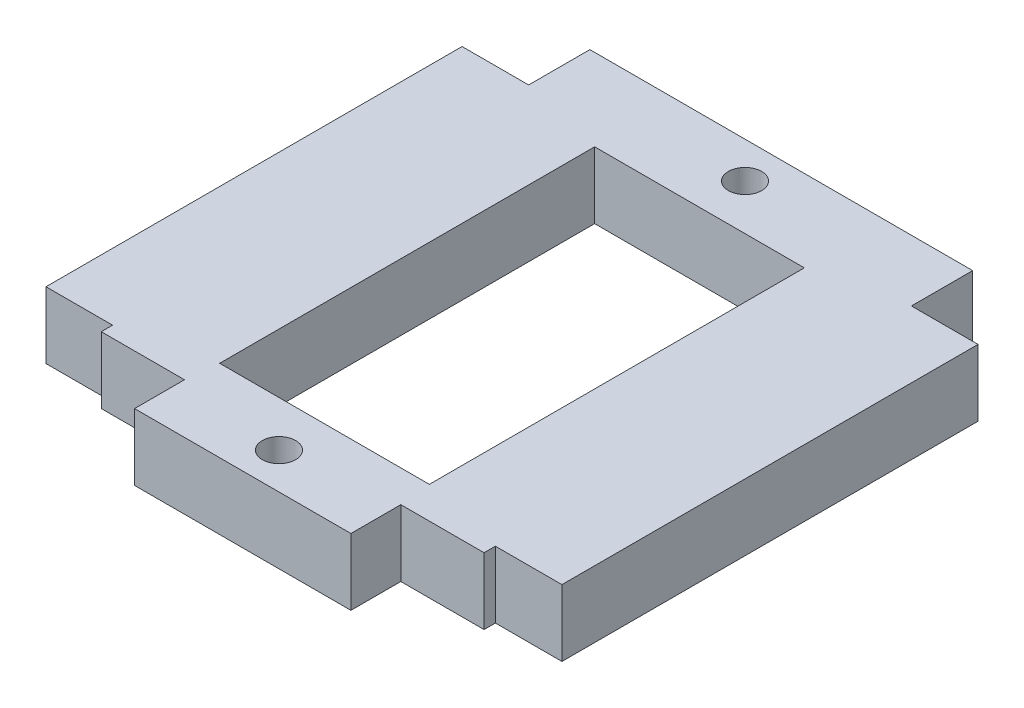
ISO-10303-21;
HEADER;
FILE_DESCRIPTION(('STEP AP214'),'2;1');
FILE_NAME('part.step','',(''),(''),'','','');
FILE_SCHEMA(('AUTOMOTIVE_DESIGN { 1 0 10303 214 1 1 1 1 }'));
ENDSEC;
DATA;
#1=APPLICATION_CONTEXT('core data for automotive mechanical design processes');
#2=APPLICATION_PROTOCOL_DEFINITION('international standard','automotive_design',2000,#1);
#3=PRODUCT_CONTEXT('',#1,'mechanical');
#4=PRODUCT('Part','Part','',(#3));
#5=PRODUCT_RELATED_PRODUCT_CATEGORY('part','',(#4));
#6=PRODUCT_DEFINITION_FORMATION('','',#4);
#7=PRODUCT_DEFINITION_CONTEXT('part definition',#1,'design');
#8=PRODUCT_DEFINITION('design','',#6,#7);
#9=PRODUCT_DEFINITION_SHAPE('','',#8);
#10=(LENGTH_UNIT() NAMED_UNIT(*) SI_UNIT(.MILLI.,.METRE.));
#11=(NAMED_UNIT(*) PLANE_ANGLE_UNIT() SI_UNIT($,.RADIAN.));
#12=(NAMED_UNIT(*) SI_UNIT($,.STERADIAN.) SOLID_ANGLE_UNIT());
#13=UNCERTAINTY_MEASURE_WITH_UNIT(LENGTH_MEASURE(1.E-05),#10,'distance_accuracy_value','');
#14=(GEOMETRIC_REPRESENTATION_CONTEXT(3) GLOBAL_UNCERTAINTY_ASSIGNED_CONTEXT((#13)) GLOBAL_UNIT_ASSIGNED_CONTEXT((#10,
#11,#12)) REPRESENTATION_CONTEXT('',''));
#15=CARTESIAN_POINT('',(0.,0.,0.));
#16=DIRECTION('',(0.,0.,1.));
#17=DIRECTION('',(1.,0.,0.));
#18=AXIS2_PLACEMENT_3D('',#15,#16,#17);
#19=CARTESIAN_POINT('',(0.,4.,6.2992));
#20=DIRECTION('',(0.,0.,1.));
#21=DIRECTION('',(1.,0.,0.));
#22=AXIS2_PLACEMENT_3D('',#19,#20,#21);
#23=PLANE('',#22);
#24=DIRECTION('',(-1.,0.,0.));
#25=VECTOR('',#24,1.);
#26=CARTESIAN_POINT('',(0.,0.,6.2992));
#27=LINE('',#26,#25);
#28=CARTESIAN_POINT('',(6.2992,0.,6.2992));
#29=VERTEX_POINT('',#28);
#30=CARTESIAN_POINT('',(-6.2992,0.,6.2992));
#31=VERTEX_POINT('',#30);
#32=EDGE_CURVE('E257',#29,#31,#27,.T.);
#33=ORIENTED_EDGE('',*,*,#32,.T.);
#34=DIRECTION('',(0.,-1.,0.));
#35=VECTOR('',#34,1.);
#36=CARTESIAN_POINT('',(-6.2992,4.,6.2992));
#37=LINE('',#36,#35);
#38=CARTESIAN_POINT('',(-6.2992,4.,6.2992));
#39=VERTEX_POINT('',#38);
#40=EDGE_CURVE('E11',#39,#31,#37,.T.);
#41=ORIENTED_EDGE('',*,*,#40,.F.);
#42=DIRECTION('',(-1.,0.,0.));
#43=VECTOR('',#42,1.);
#44=CARTESIAN_POINT('',(0.,4.,6.2992));
#45=LINE('',#44,#43);
#46=CARTESIAN_POINT('',(6.2992,4.,6.2992));
#47=VERTEX_POINT('',#46);
#48=EDGE_CURVE('E186',#47,#39,#45,.T.);
#49=ORIENTED_EDGE('',*,*,#48,.F.);
#50=DIRECTION('',(0.,-1.,0.));
#51=VECTOR('',#50,1.);
#52=CARTESIAN_POINT('',(6.2992,4.,6.2992));
#53=LINE('',#52,#51);
#54=EDGE_CURVE('E54',#47,#29,#53,.T.);
#55=ORIENTED_EDGE('',*,*,#54,.T.);
#56=EDGE_LOOP('',(#33,#41,#49,#55));
#57=FACE_BOUND('',#56,.T.);
#58=ADVANCED_FACE('F35',(#57),#23,.F.);
#59=CARTESIAN_POINT('',(-6.2992,4.,0.));
#60=DIRECTION('',(-1.,0.,0.));
#61=DIRECTION('',(0.,0.,1.));
#62=AXIS2_PLACEMENT_3D('',#59,#60,#61);
#63=PLANE('',#62);
#64=DIRECTION('',(0.,0.,-1.));
#65=VECTOR('',#64,1.);
#66=CARTESIAN_POINT('',(-6.2992,0.,0.));
#67=LINE('',#66,#65);
#68=CARTESIAN_POINT('',(-6.2992,0.,-16.2306));
#69=VERTEX_POINT('',#68);
#70=EDGE_CURVE('E192',#31,#69,#67,.T.);
#71=ORIENTED_EDGE('',*,*,#70,.T.);
#72=DIRECTION('',(0.,-1.,0.));
#73=VECTOR('',#72,1.);
#74=CARTESIAN_POINT('',(-6.2992,4.,-16.2306));
#75=LINE('',#74,#73);
#76=CARTESIAN_POINT('',(-6.2992,4.,-16.2306));
#77=VERTEX_POINT('',#76);
#78=EDGE_CURVE('E45',#77,#69,#75,.T.);
#79=ORIENTED_EDGE('',*,*,#78,.F.);
#80=DIRECTION('',(0.,0.,-1.));
#81=VECTOR('',#80,1.);
#82=CARTESIAN_POINT('',(-6.2992,4.,0.));
#83=LINE('',#82,#81);
#84=EDGE_CURVE('E180',#39,#77,#83,.T.);
#85=ORIENTED_EDGE('',*,*,#84,.F.);
#86=ORIENTED_EDGE('',*,*,#40,.T.);
#87=EDGE_LOOP('',(#71,#79,#85,#86));
#88=FACE_BOUND('',#87,.T.);
#89=ADVANCED_FACE('F191',(#88),#63,.F.);
#90=CARTESIAN_POINT('',(0.,4.,-16.2306));
#91=DIRECTION('',(0.,0.,1.));
#92=DIRECTION('',(1.,0.,0.));
#93=AXIS2_PLACEMENT_3D('',#90,#91,#92);
#94=PLANE('',#93);
#95=DIRECTION('',(-1.,0.,0.));
#96=VECTOR('',#95,1.);
#97=CARTESIAN_POINT('',(0.,0.,-16.2306));
#98=LINE('',#97,#96);
#99=CARTESIAN_POINT('',(6.2992,0.,-16.2306));
#100=VERTEX_POINT('',#99);
#101=EDGE_CURVE('E260',#100,#69,#98,.T.);
#102=ORIENTED_EDGE('',*,*,#101,.F.);
#103=DIRECTION('',(0.,-1.,0.));
#104=VECTOR('',#103,1.);
#105=CARTESIAN_POINT('',(6.2992,4.,-16.2306));
#106=LINE('',#105,#104);
#107=CARTESIAN_POINT('',(6.2992,4.,-16.2306));
#108=VERTEX_POINT('',#107);
#109=EDGE_CURVE('E116',#108,#100,#106,.T.);
#110=ORIENTED_EDGE('',*,*,#109,.F.);
#111=DIRECTION('',(-1.,0.,0.));
#112=VECTOR('',#111,1.);
#113=CARTESIAN_POINT('',(0.,4.,-16.2306));
#114=LINE('',#113,#112);
#115=EDGE_CURVE('E185',#108,#77,#114,.T.);
#116=ORIENTED_EDGE('',*,*,#115,.T.);
#117=ORIENTED_EDGE('',*,*,#78,.T.);
#118=EDGE_LOOP('',(#102,#110,#116,#117));
#119=FACE_BOUND('',#118,.T.);
#120=ADVANCED_FACE('F196',(#119),#94,.T.);
#121=CARTESIAN_POINT('',(-6.49999999999999,4.,0.));
#122=DIRECTION('',(-1.,0.,0.));
#123=DIRECTION('',(0.,0.,1.));
#124=AXIS2_PLACEMENT_3D('',#121,#122,#123);
#125=PLANE('',#124);
#126=DIRECTION('',(0.,0.,-1.));
#127=VECTOR('',#126,1.);
#128=CARTESIAN_POINT('',(-6.49999999999999,0.,0.));
#129=LINE('',#128,#127);
#130=CARTESIAN_POINT('',(-6.49999999999999,0.,11.2141000000001));
#131=VERTEX_POINT('',#130);
#132=CARTESIAN_POINT('',(-6.49999999999999,0.,8.21410000000005));
#133=VERTEX_POINT('',#132);
#134=EDGE_CURVE('E203',#131,#133,#129,.T.);
#135=ORIENTED_EDGE('',*,*,#134,.F.);
#136=DIRECTION('',(0.,-1.,0.));
#137=VECTOR('',#136,1.);
#138=CARTESIAN_POINT('',(-6.49999999999999,4.,11.2141000000001));
#139=LINE('',#138,#137);
#140=CARTESIAN_POINT('',(-6.49999999999999,4.,11.2141000000001));
#141=VERTEX_POINT('',#140);
#142=EDGE_CURVE('E39',#141,#131,#139,.T.);
#143=ORIENTED_EDGE('',*,*,#142,.F.);
#144=DIRECTION('',(0.,0.,-1.));
#145=VECTOR('',#144,1.);
#146=CARTESIAN_POINT('',(-6.49999999999999,4.,0.));
#147=LINE('',#146,#145);
#148=CARTESIAN_POINT('',(-6.49999999999999,4.,8.21410000000005));
#149=VERTEX_POINT('',#148);
#150=EDGE_CURVE('E265',#141,#149,#147,.T.);
#151=ORIENTED_EDGE('',*,*,#150,.T.);
#152=DIRECTION('',(0.,-1.,0.));
#153=VECTOR('',#152,1.);
#154=CARTESIAN_POINT('',(-6.49999999999999,4.,8.21410000000005));
#155=LINE('',#154,#153);
#156=EDGE_CURVE('E199',#149,#133,#155,.T.);
#157=ORIENTED_EDGE('',*,*,#156,.T.);
#158=EDGE_LOOP('',(#135,#143,#151,#157));
#159=FACE_BOUND('',#158,.T.);
#160=ADVANCED_FACE('F37',(#159),#125,.T.);
#161=CARTESIAN_POINT('',(0.,4.,11.2141000000001));
#162=DIRECTION('',(0.,0.,1.));
#163=DIRECTION('',(1.,0.,0.));
#164=AXIS2_PLACEMENT_3D('',#161,#162,#163);
#165=PLANE('',#164);
#166=DIRECTION('',(-1.,0.,0.));
#167=VECTOR('',#166,1.);
#168=CARTESIAN_POINT('',(0.,0.,11.2141000000001));
#169=LINE('',#168,#167);
#170=CARTESIAN_POINT('',(6.50000000000001,0.,11.2141000000001));
#171=VERTEX_POINT('',#170);
#172=EDGE_CURVE('E206',#171,#131,#169,.T.);
#173=ORIENTED_EDGE('',*,*,#172,.F.);
#174=DIRECTION('',(0.,-1.,0.));
#175=VECTOR('',#174,1.);
#176=CARTESIAN_POINT('',(6.50000000000001,4.,11.2141000000001));
#177=LINE('',#176,#175);
#178=CARTESIAN_POINT('',(6.50000000000001,4.,11.2141000000001));
#179=VERTEX_POINT('',#178);
#180=EDGE_CURVE('E294',#179,#171,#177,.T.);
#181=ORIENTED_EDGE('',*,*,#180,.F.);
#182=DIRECTION('',(-1.,0.,0.));
#183=VECTOR('',#182,1.);
#184=CARTESIAN_POINT('',(0.,4.,11.2141000000001));
#185=LINE('',#184,#183);
#186=EDGE_CURVE('E303',#179,#141,#185,.T.);
#187=ORIENTED_EDGE('',*,*,#186,.T.);
#188=ORIENTED_EDGE('',*,*,#142,.T.);
#189=EDGE_LOOP('',(#173,#181,#187,#188));
#190=FACE_BOUND('',#189,.T.);
#191=ADVANCED_FACE('F301',(#190),#165,.T.);
#192=CARTESIAN_POINT('',(6.50000000000001,4.,0.));
#193=DIRECTION('',(-1.,0.,0.));
#194=DIRECTION('',(0.,0.,1.));
#195=AXIS2_PLACEMENT_3D('',#192,#193,#194);
#196=PLANE('',#195);
#197=DIRECTION('',(0.,0.,-1.));
#198=VECTOR('',#197,1.);
#199=CARTESIAN_POINT('',(6.50000000000001,0.,0.));
#200=LINE('',#199,#198);
#201=CARTESIAN_POINT('',(6.50000000000001,0.,8.21410000000005));
#202=VERTEX_POINT('',#201);
#203=EDGE_CURVE('E209',#171,#202,#200,.T.);
#204=ORIENTED_EDGE('',*,*,#203,.T.);
#205=DIRECTION('',(0.,-1.,0.));
#206=VECTOR('',#205,1.);
#207=CARTESIAN_POINT('',(6.50000000000001,4.,8.21410000000005));
#208=LINE('',#207,#206);
#209=CARTESIAN_POINT('',(6.50000000000001,4.,8.21410000000005));
#210=VERTEX_POINT('',#209);
#211=EDGE_CURVE('E293',#210,#202,#208,.T.);
#212=ORIENTED_EDGE('',*,*,#211,.F.);
#213=DIRECTION('',(0.,0.,-1.));
#214=VECTOR('',#213,1.);
#215=CARTESIAN_POINT('',(6.50000000000001,4.,0.));
#216=LINE('',#215,#214);
#217=EDGE_CURVE('E313',#179,#210,#216,.T.);
#218=ORIENTED_EDGE('',*,*,#217,.F.);
#219=ORIENTED_EDGE('',*,*,#180,.T.);
#220=EDGE_LOOP('',(#204,#212,#218,#219));
#221=FACE_BOUND('',#220,.T.);
#222=ADVANCED_FACE('F311',(#221),#196,.F.);
#223=CARTESIAN_POINT('',(0.,4.,8.21410000000005));
#224=DIRECTION('',(0.,0.,1.));
#225=DIRECTION('',(1.,0.,0.));
#226=AXIS2_PLACEMENT_3D('',#223,#224,#225);
#227=PLANE('',#226);
#228=DIRECTION('',(-1.,0.,0.));
#229=VECTOR('',#228,1.);
#230=CARTESIAN_POINT('',(0.,0.,8.21410000000005));
#231=LINE('',#230,#229);
#232=CARTESIAN_POINT('',(11.5,0.,8.21410000000005));
#233=VERTEX_POINT('',#232);
#234=EDGE_CURVE('E212',#233,#202,#231,.T.);
#235=ORIENTED_EDGE('',*,*,#234,.F.);
#236=DIRECTION('',(0.,-1.,0.));
#237=VECTOR('',#236,1.);
#238=CARTESIAN_POINT('',(11.5,4.,8.21410000000005));
#239=LINE('',#238,#237);
#240=CARTESIAN_POINT('',(11.5,4.,8.21410000000005));
#241=VERTEX_POINT('',#240);
#242=EDGE_CURVE('E291',#241,#233,#239,.T.);
#243=ORIENTED_EDGE('',*,*,#242,.F.);
#244=DIRECTION('',(-1.,0.,0.));
#245=VECTOR('',#244,1.);
#246=CARTESIAN_POINT('',(0.,4.,8.21410000000005));
#247=LINE('',#246,#245);
#248=EDGE_CURVE('E316',#241,#210,#247,.T.);
#249=ORIENTED_EDGE('',*,*,#248,.T.);
#250=ORIENTED_EDGE('',*,*,#211,.T.);
#251=EDGE_LOOP('',(#235,#243,#249,#250));
#252=FACE_BOUND('',#251,.T.);
#253=ADVANCED_FACE('F317',(#252),#227,.T.);
#254=CARTESIAN_POINT('',(11.5,4.,0.));
#255=DIRECTION('',(1.,0.,0.));
#256=DIRECTION('',(0.,0.,-1.));
#257=AXIS2_PLACEMENT_3D('',#254,#255,#256);
#258=PLANE('',#257);
#259=DIRECTION('',(0.,0.,1.));
#260=VECTOR('',#259,1.);
#261=CARTESIAN_POINT('',(11.5,0.,0.));
#262=LINE('',#261,#260);
#263=CARTESIAN_POINT('',(11.5,0.,7.53430000000001));
#264=VERTEX_POINT('',#263);
#265=EDGE_CURVE('E215',#264,#233,#262,.T.);
#266=ORIENTED_EDGE('',*,*,#265,.F.);
#267=DIRECTION('',(0.,-1.,0.));
#268=VECTOR('',#267,1.);
#269=CARTESIAN_POINT('',(11.5,4.,7.53430000000001));
#270=LINE('',#269,#268);
#271=CARTESIAN_POINT('',(11.5,4.,7.53430000000001));
#272=VERTEX_POINT('',#271);
#273=EDGE_CURVE('E289',#272,#264,#270,.T.);
#274=ORIENTED_EDGE('',*,*,#273,.F.);
#275=DIRECTION('',(0.,0.,1.));
#276=VECTOR('',#275,1.);
#277=CARTESIAN_POINT('',(11.5,4.,0.));
#278=LINE('',#277,#276);
#279=EDGE_CURVE('E321',#272,#241,#278,.T.);
#280=ORIENTED_EDGE('',*,*,#279,.T.);
#281=ORIENTED_EDGE('',*,*,#242,.T.);
#282=EDGE_LOOP('',(#266,#274,#280,#281));
#283=FACE_BOUND('',#282,.T.);
#284=ADVANCED_FACE('F435',(#283),#258,.T.);
#285=CARTESIAN_POINT('',(0.,4.,7.5343));
#286=DIRECTION('',(0.,0.,1.));
#287=DIRECTION('',(1.,0.,0.));
#288=AXIS2_PLACEMENT_3D('',#285,#286,#287);
#289=PLANE('',#288);
#290=DIRECTION('',(-1.,0.,0.));
#291=VECTOR('',#290,1.);
#292=CARTESIAN_POINT('',(0.,0.,7.5343));
#293=LINE('',#292,#291);
#294=CARTESIAN_POINT('',(15.5,0.,7.53430000000001));
#295=VERTEX_POINT('',#294);
#296=EDGE_CURVE('E218',#295,#264,#293,.T.);
#297=ORIENTED_EDGE('',*,*,#296,.F.);
#298=DIRECTION('',(0.,-1.,0.));
#299=VECTOR('',#298,1.);
#300=CARTESIAN_POINT('',(15.5,4.,7.53430000000001));
#301=LINE('',#300,#299);
#302=CARTESIAN_POINT('',(15.5,4.,7.53430000000001));
#303=VERTEX_POINT('',#302);
#304=EDGE_CURVE('E287',#303,#295,#301,.T.);
#305=ORIENTED_EDGE('',*,*,#304,.F.);
#306=DIRECTION('',(-1.,0.,0.));
#307=VECTOR('',#306,1.);
#308=CARTESIAN_POINT('',(0.,4.,7.5343));
#309=LINE('',#308,#307);
#310=EDGE_CURVE('E323',#303,#272,#309,.T.);
#311=ORIENTED_EDGE('',*,*,#310,.T.);
#312=ORIENTED_EDGE('',*,*,#273,.T.);
#313=EDGE_LOOP('',(#297,#305,#311,#312));
#314=FACE_BOUND('',#313,.T.);
#315=ADVANCED_FACE('F431',(#314),#289,.T.);
#316=CARTESIAN_POINT('',(15.5,4.,0.));
#317=DIRECTION('',(-1.,0.,0.));
#318=DIRECTION('',(0.,0.,1.));
#319=AXIS2_PLACEMENT_3D('',#316,#317,#318);
#320=PLANE('',#319);
#321=DIRECTION('',(0.,0.,-1.));
#322=VECTOR('',#321,1.);
#323=CARTESIAN_POINT('',(15.5,0.,0.));
#324=LINE('',#323,#322);
#325=CARTESIAN_POINT('',(15.5,0.,-17.4657));
#326=VERTEX_POINT('',#325);
#327=EDGE_CURVE('E221',#295,#326,#324,.T.);
#328=ORIENTED_EDGE('',*,*,#327,.T.);
#329=DIRECTION('',(0.,-1.,0.));
#330=VECTOR('',#329,1.);
#331=CARTESIAN_POINT('',(15.5,4.,-17.4657));
#332=LINE('',#331,#330);
#333=CARTESIAN_POINT('',(15.5,4.,-17.4657));
#334=VERTEX_POINT('',#333);
#335=EDGE_CURVE('E285',#334,#326,#332,.T.);
#336=ORIENTED_EDGE('',*,*,#335,.F.);
#337=DIRECTION('',(0.,0.,-1.));
#338=VECTOR('',#337,1.);
#339=CARTESIAN_POINT('',(15.5,4.,0.));
#340=LINE('',#339,#338);
#341=EDGE_CURVE('E330',#303,#334,#340,.T.);
#342=ORIENTED_EDGE('',*,*,#341,.F.);
#343=ORIENTED_EDGE('',*,*,#304,.T.);
#344=EDGE_LOOP('',(#328,#336,#342,#343));
#345=FACE_BOUND('',#344,.T.);
#346=ADVANCED_FACE('F427',(#345),#320,.F.);
#347=CARTESIAN_POINT('',(0.,4.,-17.4657));
#348=DIRECTION('',(0.,0.,-1.));
#349=DIRECTION('',(-1.,0.,0.));
#350=AXIS2_PLACEMENT_3D('',#347,#348,#349);
#351=PLANE('',#350);
#352=DIRECTION('',(1.,0.,0.));
#353=VECTOR('',#352,1.);
#354=CARTESIAN_POINT('',(0.,0.,-17.4657));
#355=LINE('',#354,#353);
#356=CARTESIAN_POINT('',(11.5,0.,-17.4657));
#357=VERTEX_POINT('',#356);
#358=EDGE_CURVE('E224',#357,#326,#355,.T.);
#359=ORIENTED_EDGE('',*,*,#358,.F.);
#360=DIRECTION('',(0.,-1.,0.));
#361=VECTOR('',#360,1.);
#362=CARTESIAN_POINT('',(11.5,4.,-17.4657));
#363=LINE('',#362,#361);
#364=CARTESIAN_POINT('',(11.5,4.,-17.4657));
#365=VERTEX_POINT('',#364);
#366=EDGE_CURVE('E283',#365,#357,#363,.T.);
#367=ORIENTED_EDGE('',*,*,#366,.F.);
#368=DIRECTION('',(1.,0.,0.));
#369=VECTOR('',#368,1.);
#370=CARTESIAN_POINT('',(0.,4.,-17.4657));
#371=LINE('',#370,#369);
#372=EDGE_CURVE('E332',#365,#334,#371,.T.);
#373=ORIENTED_EDGE('',*,*,#372,.T.);
#374=ORIENTED_EDGE('',*,*,#335,.T.);
#375=EDGE_LOOP('',(#359,#367,#373,#374));
#376=FACE_BOUND('',#375,.T.);
#377=ADVANCED_FACE('F423',(#376),#351,.T.);
#378=CARTESIAN_POINT('',(11.5,4.,0.));
#379=DIRECTION('',(1.,0.,0.));
#380=DIRECTION('',(0.,0.,-1.));
#381=AXIS2_PLACEMENT_3D('',#378,#379,#380);
#382=PLANE('',#381);
#383=DIRECTION('',(0.,0.,1.));
#384=VECTOR('',#383,1.);
#385=CARTESIAN_POINT('',(11.5,0.,0.));
#386=LINE('',#385,#384);
#387=CARTESIAN_POINT('',(11.5,0.,-21.1455000000001));
#388=VERTEX_POINT('',#387);
#389=EDGE_CURVE('E227',#388,#357,#386,.T.);
#390=ORIENTED_EDGE('',*,*,#389,.F.);
#391=DIRECTION('',(0.,-1.,0.));
#392=VECTOR('',#391,1.);
#393=CARTESIAN_POINT('',(11.5,4.,-21.1455000000001));
#394=LINE('',#393,#392);
#395=CARTESIAN_POINT('',(11.5,4.,-21.1455000000001));
#396=VERTEX_POINT('',#395);
#397=EDGE_CURVE('E281',#396,#388,#394,.T.);
#398=ORIENTED_EDGE('',*,*,#397,.F.);
#399=DIRECTION('',(0.,0.,1.));
#400=VECTOR('',#399,1.);
#401=CARTESIAN_POINT('',(11.5,4.,0.));
#402=LINE('',#401,#400);
#403=EDGE_CURVE('E335',#396,#365,#402,.T.);
#404=ORIENTED_EDGE('',*,*,#403,.T.);
#405=ORIENTED_EDGE('',*,*,#366,.T.);
#406=EDGE_LOOP('',(#390,#398,#404,#405));
#407=FACE_BOUND('',#406,.T.);
#408=ADVANCED_FACE('F419',(#407),#382,.T.);
#409=CARTESIAN_POINT('',(0.,4.,-21.1455000000001));
#410=DIRECTION('',(0.,0.,-1.));
#411=DIRECTION('',(-1.,0.,0.));
#412=AXIS2_PLACEMENT_3D('',#409,#410,#411);
#413=PLANE('',#412);
#414=DIRECTION('',(1.,0.,0.));
#415=VECTOR('',#414,1.);
#416=CARTESIAN_POINT('',(0.,0.,-21.1455000000001));
#417=LINE('',#416,#415);
#418=CARTESIAN_POINT('',(-11.5,0.,-21.1455000000001));
#419=VERTEX_POINT('',#418);
#420=EDGE_CURVE('E230',#419,#388,#417,.T.);
#421=ORIENTED_EDGE('',*,*,#420,.F.);
#422=DIRECTION('',(0.,-1.,0.));
#423=VECTOR('',#422,1.);
#424=CARTESIAN_POINT('',(-11.5,4.,-21.1455000000001));
#425=LINE('',#424,#423);
#426=CARTESIAN_POINT('',(-11.5,4.,-21.1455000000001));
#427=VERTEX_POINT('',#426);
#428=EDGE_CURVE('E279',#427,#419,#425,.T.);
#429=ORIENTED_EDGE('',*,*,#428,.F.);
#430=DIRECTION('',(1.,0.,0.));
#431=VECTOR('',#430,1.);
#432=CARTESIAN_POINT('',(0.,4.,-21.1455000000001));
#433=LINE('',#432,#431);
#434=EDGE_CURVE('E338',#427,#396,#433,.T.);
#435=ORIENTED_EDGE('',*,*,#434,.T.);
#436=ORIENTED_EDGE('',*,*,#397,.T.);
#437=EDGE_LOOP('',(#421,#429,#435,#436));
#438=FACE_BOUND('',#437,.T.);
#439=ADVANCED_FACE('F415',(#438),#413,.T.);
#440=CARTESIAN_POINT('',(-11.5,4.,0.));
#441=DIRECTION('',(-1.,0.,0.));
#442=DIRECTION('',(0.,0.,1.));
#443=AXIS2_PLACEMENT_3D('',#440,#441,#442);
#444=PLANE('',#443);
#445=DIRECTION('',(0.,0.,-1.));
#446=VECTOR('',#445,1.);
#447=CARTESIAN_POINT('',(-11.5,0.,0.));
#448=LINE('',#447,#446);
#449=CARTESIAN_POINT('',(-11.5,0.,-17.4657));
#450=VERTEX_POINT('',#449);
#451=EDGE_CURVE('E233',#450,#419,#448,.T.);
#452=ORIENTED_EDGE('',*,*,#451,.F.);
#453=DIRECTION('',(0.,-1.,0.));
#454=VECTOR('',#453,1.);
#455=CARTESIAN_POINT('',(-11.5,4.,-17.4657));
#456=LINE('',#455,#454);
#457=CARTESIAN_POINT('',(-11.5,4.,-17.4657));
#458=VERTEX_POINT('',#457);
#459=EDGE_CURVE('E277',#458,#450,#456,.T.);
#460=ORIENTED_EDGE('',*,*,#459,.F.);
#461=DIRECTION('',(0.,0.,-1.));
#462=VECTOR('',#461,1.);
#463=CARTESIAN_POINT('',(-11.5,4.,0.));
#464=LINE('',#463,#462);
#465=EDGE_CURVE('E341',#458,#427,#464,.T.);
#466=ORIENTED_EDGE('',*,*,#465,.T.);
#467=ORIENTED_EDGE('',*,*,#428,.T.);
#468=EDGE_LOOP('',(#452,#460,#466,#467));
#469=FACE_BOUND('',#468,.T.);
#470=ADVANCED_FACE('F411',(#469),#444,.T.);
#471=CARTESIAN_POINT('',(0.,4.,-17.4657));
#472=DIRECTION('',(0.,0.,-1.));
#473=DIRECTION('',(-1.,0.,0.));
#474=AXIS2_PLACEMENT_3D('',#471,#472,#473);
#475=PLANE('',#474);
#476=DIRECTION('',(1.,0.,0.));
#477=VECTOR('',#476,1.);
#478=CARTESIAN_POINT('',(0.,0.,-17.4657));
#479=LINE('',#478,#477);
#480=CARTESIAN_POINT('',(-15.5,0.,-17.4657));
#481=VERTEX_POINT('',#480);
#482=EDGE_CURVE('E236',#481,#450,#479,.T.);
#483=ORIENTED_EDGE('',*,*,#482,.F.);
#484=DIRECTION('',(0.,-1.,0.));
#485=VECTOR('',#484,1.);
#486=CARTESIAN_POINT('',(-15.5,4.,-17.4657));
#487=LINE('',#486,#485);
#488=CARTESIAN_POINT('',(-15.5,4.,-17.4657));
#489=VERTEX_POINT('',#488);
#490=EDGE_CURVE('E275',#489,#481,#487,.T.);
#491=ORIENTED_EDGE('',*,*,#490,.F.);
#492=DIRECTION('',(1.,0.,0.));
#493=VECTOR('',#492,1.);
#494=CARTESIAN_POINT('',(0.,4.,-17.4657));
#495=LINE('',#494,#493);
#496=EDGE_CURVE('E344',#489,#458,#495,.T.);
#497=ORIENTED_EDGE('',*,*,#496,.T.);
#498=ORIENTED_EDGE('',*,*,#459,.T.);
#499=EDGE_LOOP('',(#483,#491,#497,#498));
#500=FACE_BOUND('',#499,.T.);
#501=ADVANCED_FACE('F407',(#500),#475,.T.);
#502=CARTESIAN_POINT('',(-15.5,4.,0.));
#503=DIRECTION('',(-1.,0.,0.));
#504=DIRECTION('',(0.,0.,1.));
#505=AXIS2_PLACEMENT_3D('',#502,#503,#504);
#506=PLANE('',#505);
#507=DIRECTION('',(0.,0.,-1.));
#508=VECTOR('',#507,1.);
#509=CARTESIAN_POINT('',(-15.5,0.,0.));
#510=LINE('',#509,#508);
#511=CARTESIAN_POINT('',(-15.5,0.,7.53429999999999));
#512=VERTEX_POINT('',#511);
#513=EDGE_CURVE('E239',#512,#481,#510,.T.);
#514=ORIENTED_EDGE('',*,*,#513,.F.);
#515=DIRECTION('',(0.,-1.,0.));
#516=VECTOR('',#515,1.);
#517=CARTESIAN_POINT('',(-15.5,4.,7.53429999999999));
#518=LINE('',#517,#516);
#519=CARTESIAN_POINT('',(-15.5,4.,7.53429999999999));
#520=VERTEX_POINT('',#519);
#521=EDGE_CURVE('E273',#520,#512,#518,.T.);
#522=ORIENTED_EDGE('',*,*,#521,.F.);
#523=DIRECTION('',(0.,0.,-1.));
#524=VECTOR('',#523,1.);
#525=CARTESIAN_POINT('',(-15.5,4.,0.));
#526=LINE('',#525,#524);
#527=EDGE_CURVE('E347',#520,#489,#526,.T.);
#528=ORIENTED_EDGE('',*,*,#527,.T.);
#529=ORIENTED_EDGE('',*,*,#490,.T.);
#530=EDGE_LOOP('',(#514,#522,#528,#529));
#531=FACE_BOUND('',#530,.T.);
#532=ADVANCED_FACE('F403',(#531),#506,.T.);
#533=CARTESIAN_POINT('',(0.,4.,7.53429999999999));
#534=DIRECTION('',(0.,0.,1.));
#535=DIRECTION('',(1.,0.,0.));
#536=AXIS2_PLACEMENT_3D('',#533,#534,#535);
#537=PLANE('',#536);
#538=DIRECTION('',(-1.,0.,0.));
#539=VECTOR('',#538,1.);
#540=CARTESIAN_POINT('',(0.,0.,7.53429999999999));
#541=LINE('',#540,#539);
#542=CARTESIAN_POINT('',(-11.5,0.,7.53429999999999));
#543=VERTEX_POINT('',#542);
#544=EDGE_CURVE('E242',#543,#512,#541,.T.);
#545=ORIENTED_EDGE('',*,*,#544,.F.);
#546=DIRECTION('',(0.,-1.,0.));
#547=VECTOR('',#546,1.);
#548=CARTESIAN_POINT('',(-11.5,4.,7.53429999999999));
#549=LINE('',#548,#547);
#550=CARTESIAN_POINT('',(-11.5,4.,7.53429999999999));
#551=VERTEX_POINT('',#550);
#552=EDGE_CURVE('E271',#551,#543,#549,.T.);
#553=ORIENTED_EDGE('',*,*,#552,.F.);
#554=DIRECTION('',(-1.,0.,0.));
#555=VECTOR('',#554,1.);
#556=CARTESIAN_POINT('',(0.,4.,7.53429999999999));
#557=LINE('',#556,#555);
#558=EDGE_CURVE('E350',#551,#520,#557,.T.);
#559=ORIENTED_EDGE('',*,*,#558,.T.);
#560=ORIENTED_EDGE('',*,*,#521,.T.);
#561=EDGE_LOOP('',(#545,#553,#559,#560));
#562=FACE_BOUND('',#561,.T.);
#563=ADVANCED_FACE('F399',(#562),#537,.T.);
#564=CARTESIAN_POINT('',(-11.5,4.,0.));
#565=DIRECTION('',(-1.,0.,0.));
#566=DIRECTION('',(0.,0.,1.));
#567=AXIS2_PLACEMENT_3D('',#564,#565,#566);
#568=PLANE('',#567);
#569=DIRECTION('',(0.,0.,-1.));
#570=VECTOR('',#569,1.);
#571=CARTESIAN_POINT('',(-11.5,0.,0.));
#572=LINE('',#571,#570);
#573=CARTESIAN_POINT('',(-11.5,0.,8.21410000000005));
#574=VERTEX_POINT('',#573);
#575=EDGE_CURVE('E245',#574,#543,#572,.T.);
#576=ORIENTED_EDGE('',*,*,#575,.F.);
#577=DIRECTION('',(0.,-1.,0.));
#578=VECTOR('',#577,1.);
#579=CARTESIAN_POINT('',(-11.5,4.,8.21410000000005));
#580=LINE('',#579,#578);
#581=CARTESIAN_POINT('',(-11.5,4.,8.21410000000005));
#582=VERTEX_POINT('',#581);
#583=EDGE_CURVE('E269',#582,#574,#580,.T.);
#584=ORIENTED_EDGE('',*,*,#583,.F.);
#585=DIRECTION('',(0.,0.,-1.));
#586=VECTOR('',#585,1.);
#587=CARTESIAN_POINT('',(-11.5,4.,0.));
#588=LINE('',#587,#586);
#589=EDGE_CURVE('E353',#582,#551,#588,.T.);
#590=ORIENTED_EDGE('',*,*,#589,.T.);
#591=ORIENTED_EDGE('',*,*,#552,.T.);
#592=EDGE_LOOP('',(#576,#584,#590,#591));
#593=FACE_BOUND('',#592,.T.);
#594=ADVANCED_FACE('F390',(#593),#568,.T.);
#595=CARTESIAN_POINT('',(0.,4.,-18.9674000000001));
#596=DIRECTION('',(0.,-1.,0.));
#597=DIRECTION('',(0.,0.,-1.));
#598=AXIS2_PLACEMENT_3D('',#595,#596,#597);
#599=CYLINDRICAL_SURFACE('',#598,1.);
#600=CARTESIAN_POINT('',(0.,4.,-18.9674000000001));
#601=DIRECTION('',(0.,1.,0.));
#602=DIRECTION('',(0.,0.,1.));
#603=AXIS2_PLACEMENT_3D('',#600,#601,#602);
#604=CIRCLE('',#603,1.);
#605=CARTESIAN_POINT('',(0.,4.,-17.9674000000001));
#606=VERTEX_POINT('',#605);
#607=EDGE_CURVE('E361',#606,#606,#604,.T.);
#608=ORIENTED_EDGE('',*,*,#607,.T.);
#609=EDGE_LOOP('',(#608));
#610=FACE_BOUND('',#609,.T.);
#611=CARTESIAN_POINT('',(0.,0.,-18.9674000000001));
#612=DIRECTION('',(0.,1.,0.));
#613=DIRECTION('',(0.,0.,1.));
#614=AXIS2_PLACEMENT_3D('',#611,#612,#613);
#615=CIRCLE('',#614,1.);
#616=CARTESIAN_POINT('',(0.,0.,-17.9674000000001));
#617=VERTEX_POINT('',#616);
#618=EDGE_CURVE('E254',#617,#617,#615,.T.);
#619=ORIENTED_EDGE('',*,*,#618,.F.);
#620=EDGE_LOOP('',(#619));
#621=FACE_BOUND('',#620,.T.);
#622=ADVANCED_FACE('F365',(#610,#621),#599,.F.);
#623=CARTESIAN_POINT('',(0.,4.,9.03599999999993));
#624=DIRECTION('',(0.,-1.,0.));
#625=DIRECTION('',(0.,0.,-1.));
#626=AXIS2_PLACEMENT_3D('',#623,#624,#625);
#627=CYLINDRICAL_SURFACE('',#626,1.);
#628=CARTESIAN_POINT('',(0.,4.,9.03599999999993));
#629=DIRECTION('',(0.,1.,0.));
#630=DIRECTION('',(0.,0.,1.));
#631=AXIS2_PLACEMENT_3D('',#628,#629,#630);
#632=CIRCLE('',#631,1.);
#633=CARTESIAN_POINT('',(0.,4.,10.0359999999999));
#634=VERTEX_POINT('',#633);
#635=EDGE_CURVE('E358',#634,#634,#632,.T.);
#636=ORIENTED_EDGE('',*,*,#635,.T.);
#637=EDGE_LOOP('',(#636));
#638=FACE_BOUND('',#637,.T.);
#639=CARTESIAN_POINT('',(0.,0.,9.03599999999993));
#640=DIRECTION('',(0.,1.,0.));
#641=DIRECTION('',(0.,0.,1.));
#642=AXIS2_PLACEMENT_3D('',#639,#640,#641);
#643=CIRCLE('',#642,1.);
#644=CARTESIAN_POINT('',(0.,0.,10.0359999999999));
#645=VERTEX_POINT('',#644);
#646=EDGE_CURVE('E251',#645,#645,#643,.T.);
#647=ORIENTED_EDGE('',*,*,#646,.F.);
#648=EDGE_LOOP('',(#647));
#649=FACE_BOUND('',#648,.T.);
#650=ADVANCED_FACE('F389',(#638,#649),#627,.F.);
#651=CARTESIAN_POINT('',(0.,4.,8.21410000000005));
#652=DIRECTION('',(0.,0.,-1.));
#653=DIRECTION('',(-1.,0.,0.));
#654=AXIS2_PLACEMENT_3D('',#651,#652,#653);
#655=PLANE('',#654);
#656=DIRECTION('',(1.,0.,0.));
#657=VECTOR('',#656,1.);
#658=CARTESIAN_POINT('',(0.,0.,8.21410000000005));
#659=LINE('',#658,#657);
#660=EDGE_CURVE('E248',#574,#133,#659,.T.);
#661=ORIENTED_EDGE('',*,*,#660,.T.);
#662=ORIENTED_EDGE('',*,*,#156,.F.);
#663=DIRECTION('',(1.,0.,0.));
#664=VECTOR('',#663,1.);
#665=CARTESIAN_POINT('',(0.,4.,8.21410000000005));
#666=LINE('',#665,#664);
#667=EDGE_CURVE('E356',#582,#149,#666,.T.);
#668=ORIENTED_EDGE('',*,*,#667,.F.);
#669=ORIENTED_EDGE('',*,*,#583,.T.);
#670=EDGE_LOOP('',(#661,#662,#668,#669));
#671=FACE_BOUND('',#670,.T.);
#672=ADVANCED_FACE('F376',(#671),#655,.F.);
#673=CARTESIAN_POINT('',(6.2992,4.,0.));
#674=DIRECTION('',(-1.,0.,0.));
#675=DIRECTION('',(0.,0.,1.));
#676=AXIS2_PLACEMENT_3D('',#673,#674,#675);
#677=PLANE('',#676);
#678=DIRECTION('',(0.,0.,-1.));
#679=VECTOR('',#678,1.);
#680=CARTESIAN_POINT('',(6.2992,0.,0.));
#681=LINE('',#680,#679);
#682=EDGE_CURVE('E262',#29,#100,#681,.T.);
#683=ORIENTED_EDGE('',*,*,#682,.F.);
#684=ORIENTED_EDGE('',*,*,#54,.F.);
#685=DIRECTION('',(0.,0.,-1.));
#686=VECTOR('',#685,1.);
#687=CARTESIAN_POINT('',(6.2992,4.,0.));
#688=LINE('',#687,#686);
#689=EDGE_CURVE('E197',#47,#108,#688,.T.);
#690=ORIENTED_EDGE('',*,*,#689,.T.);
#691=ORIENTED_EDGE('',*,*,#109,.T.);
#692=EDGE_LOOP('',(#683,#684,#690,#691));
#693=FACE_BOUND('',#692,.T.);
#694=ADVANCED_FACE('F369',(#693),#677,.T.);
#695=CARTESIAN_POINT('',(0.,4.,0.));
#696=DIRECTION('',(0.,1.,0.));
#697=DIRECTION('',(0.,0.,1.));
#698=AXIS2_PLACEMENT_3D('',#695,#696,#697);
#699=PLANE('',#698);
#700=ORIENTED_EDGE('',*,*,#150,.F.);
#701=ORIENTED_EDGE('',*,*,#186,.F.);
#702=ORIENTED_EDGE('',*,*,#217,.T.);
#703=ORIENTED_EDGE('',*,*,#248,.F.);
#704=ORIENTED_EDGE('',*,*,#279,.F.);
#705=ORIENTED_EDGE('',*,*,#310,.F.);
#706=ORIENTED_EDGE('',*,*,#341,.T.);
#707=ORIENTED_EDGE('',*,*,#372,.F.);
#708=ORIENTED_EDGE('',*,*,#403,.F.);
#709=ORIENTED_EDGE('',*,*,#434,.F.);
#710=ORIENTED_EDGE('',*,*,#465,.F.);
#711=ORIENTED_EDGE('',*,*,#496,.F.);
#712=ORIENTED_EDGE('',*,*,#527,.F.);
#713=ORIENTED_EDGE('',*,*,#558,.F.);
#714=ORIENTED_EDGE('',*,*,#589,.F.);
#715=ORIENTED_EDGE('',*,*,#667,.T.);
#716=EDGE_LOOP('',(#700,#701,#702,#703,#704,#705,#706,#707,#708,#709,#710,#711,#712,#713,#714,#715));
#717=FACE_BOUND('',#716,.T.);
#718=ORIENTED_EDGE('',*,*,#635,.F.);
#719=EDGE_LOOP('',(#718));
#720=FACE_BOUND('',#719,.T.);
#721=ORIENTED_EDGE('',*,*,#607,.F.);
#722=EDGE_LOOP('',(#721));
#723=FACE_BOUND('',#722,.T.);
#724=ORIENTED_EDGE('',*,*,#48,.T.);
#725=ORIENTED_EDGE('',*,*,#84,.T.);
#726=ORIENTED_EDGE('',*,*,#115,.F.);
#727=ORIENTED_EDGE('',*,*,#689,.F.);
#728=EDGE_LOOP('',(#724,#725,#726,#727));
#729=FACE_BOUND('',#728,.T.);
#730=ADVANCED_FACE('F182',(#717,#720,#723,#729),#699,.T.);
#731=CARTESIAN_POINT('',(0.,0.,0.));
#732=DIRECTION('',(0.,1.,0.));
#733=DIRECTION('',(0.,0.,1.));
#734=AXIS2_PLACEMENT_3D('',#731,#732,#733);
#735=PLANE('',#734);
#736=ORIENTED_EDGE('',*,*,#134,.T.);
#737=ORIENTED_EDGE('',*,*,#660,.F.);
#738=ORIENTED_EDGE('',*,*,#575,.T.);
#739=ORIENTED_EDGE('',*,*,#544,.T.);
#740=ORIENTED_EDGE('',*,*,#513,.T.);
#741=ORIENTED_EDGE('',*,*,#482,.T.);
#742=ORIENTED_EDGE('',*,*,#451,.T.);
#743=ORIENTED_EDGE('',*,*,#420,.T.);
#744=ORIENTED_EDGE('',*,*,#389,.T.);
#745=ORIENTED_EDGE('',*,*,#358,.T.);
#746=ORIENTED_EDGE('',*,*,#327,.F.);
#747=ORIENTED_EDGE('',*,*,#296,.T.);
#748=ORIENTED_EDGE('',*,*,#265,.T.);
#749=ORIENTED_EDGE('',*,*,#234,.T.);
#750=ORIENTED_EDGE('',*,*,#203,.F.);
#751=ORIENTED_EDGE('',*,*,#172,.T.);
#752=EDGE_LOOP('',(#736,#737,#738,#739,#740,#741,#742,#743,#744,#745,#746,#747,#748,#749,#750,#751));
#753=FACE_BOUND('',#752,.T.);
#754=ORIENTED_EDGE('',*,*,#646,.T.);
#755=EDGE_LOOP('',(#754));
#756=FACE_BOUND('',#755,.T.);
#757=ORIENTED_EDGE('',*,*,#618,.T.);
#758=EDGE_LOOP('',(#757));
#759=FACE_BOUND('',#758,.T.);
#760=ORIENTED_EDGE('',*,*,#32,.F.);
#761=ORIENTED_EDGE('',*,*,#682,.T.);
#762=ORIENTED_EDGE('',*,*,#101,.T.);
#763=ORIENTED_EDGE('',*,*,#70,.F.);
#764=EDGE_LOOP('',(#760,#761,#762,#763));
#765=FACE_BOUND('',#764,.T.);
#766=ADVANCED_FACE('F307',(#753,#756,#759,#765),#735,.F.);
#767=CLOSED_SHELL('',(#58,#89,#120,#160,#191,#222,#253,#284,#315,#346,#377,#408,#439,#470,#501,
#532,#563,#594,#622,#650,#672,#694,#730,#766));
#768=MANIFOLD_SOLID_BREP('B2',#767);
#769=ADVANCED_BREP_SHAPE_REPRESENTATION('',(#18,#768),#14);
#770=SHAPE_DEFINITION_REPRESENTATION(#9,#769);
ENDSEC;
END-ISO-10303-21;
